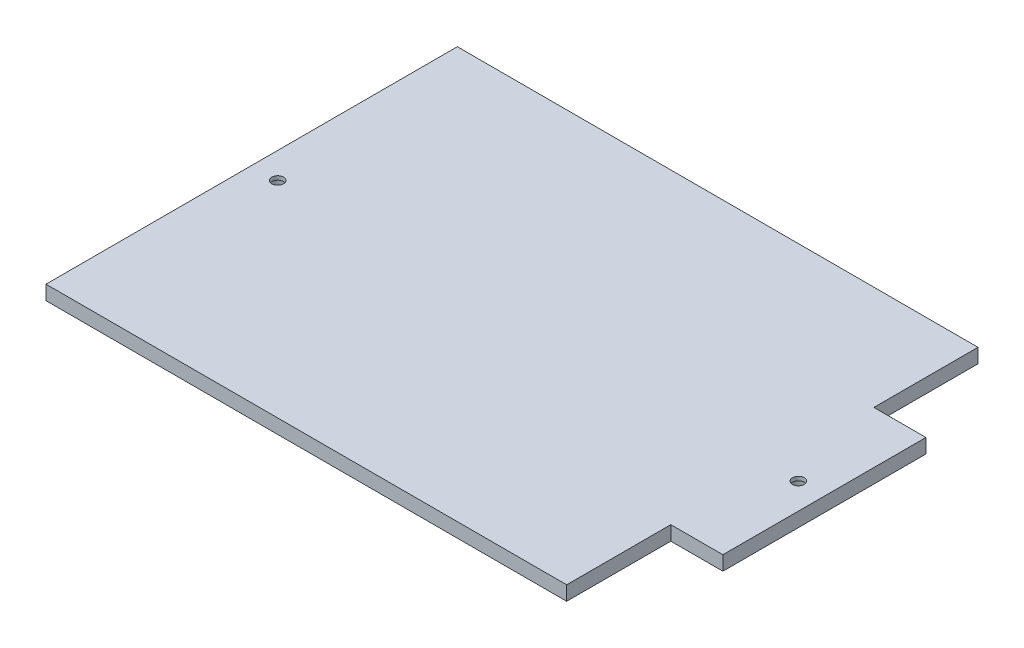
ISO-10303-21;
HEADER;
FILE_DESCRIPTION(('STEP AP214'),'2;1');
FILE_NAME('part.step','',(''),(''),'','','');
FILE_SCHEMA(('AUTOMOTIVE_DESIGN { 1 0 10303 214 1 1 1 1 }'));
ENDSEC;
DATA;
#1=APPLICATION_CONTEXT('core data for automotive mechanical design processes');
#2=APPLICATION_PROTOCOL_DEFINITION('international standard','automotive_design',2000,#1);
#3=PRODUCT_CONTEXT('',#1,'mechanical');
#4=PRODUCT('Part','Part','',(#3));
#5=PRODUCT_RELATED_PRODUCT_CATEGORY('part','',(#4));
#6=PRODUCT_DEFINITION_FORMATION('','',#4);
#7=PRODUCT_DEFINITION_CONTEXT('part definition',#1,'design');
#8=PRODUCT_DEFINITION('design','',#6,#7);
#9=PRODUCT_DEFINITION_SHAPE('','',#8);
#10=(LENGTH_UNIT() NAMED_UNIT(*) SI_UNIT(.MILLI.,.METRE.));
#11=(NAMED_UNIT(*) PLANE_ANGLE_UNIT() SI_UNIT($,.RADIAN.));
#12=(NAMED_UNIT(*) SI_UNIT($,.STERADIAN.) SOLID_ANGLE_UNIT());
#13=UNCERTAINTY_MEASURE_WITH_UNIT(LENGTH_MEASURE(1.E-05),#10,'distance_accuracy_value','');
#14=(GEOMETRIC_REPRESENTATION_CONTEXT(3) GLOBAL_UNCERTAINTY_ASSIGNED_CONTEXT((#13)) GLOBAL_UNIT_ASSIGNED_CONTEXT((#10,
#11,#12)) REPRESENTATION_CONTEXT('',''));
#15=CARTESIAN_POINT('',(0.,0.,0.));
#16=DIRECTION('',(0.,0.,1.));
#17=DIRECTION('',(1.,0.,0.));
#18=AXIS2_PLACEMENT_3D('',#15,#16,#17);
#19=CARTESIAN_POINT('',(110.,5.5,-79.));
#20=DIRECTION('',(-1.,0.,0.));
#21=DIRECTION('',(0.,0.,1.));
#22=AXIS2_PLACEMENT_3D('',#19,#20,#21);
#23=PLANE('',#22);
#24=DIRECTION('',(0.,1.,0.));
#25=VECTOR('',#24,1.);
#26=CARTESIAN_POINT('',(110.,0.,39.));
#27=LINE('',#26,#25);
#28=CARTESIAN_POINT('',(110.,0.,39.));
#29=VERTEX_POINT('',#28);
#30=CARTESIAN_POINT('',(110.,5.5,39.));
#31=VERTEX_POINT('',#30);
#32=EDGE_CURVE('E112',#29,#31,#27,.T.);
#33=ORIENTED_EDGE('',*,*,#32,.F.);
#34=DIRECTION('',(0.,0.,-1.));
#35=VECTOR('',#34,1.);
#36=CARTESIAN_POINT('',(110.,0.,-79.));
#37=LINE('',#36,#35);
#38=CARTESIAN_POINT('',(110.,0.,-39.));
#39=VERTEX_POINT('',#38);
#40=EDGE_CURVE('E124',#29,#39,#37,.T.);
#41=ORIENTED_EDGE('',*,*,#40,.T.);
#42=DIRECTION('',(0.,1.,0.));
#43=VECTOR('',#42,1.);
#44=CARTESIAN_POINT('',(110.,0.,-39.));
#45=LINE('',#44,#43);
#46=CARTESIAN_POINT('',(110.,5.5,-39.));
#47=VERTEX_POINT('',#46);
#48=EDGE_CURVE('E198',#39,#47,#45,.T.);
#49=ORIENTED_EDGE('',*,*,#48,.T.);
#50=DIRECTION('',(0.,0.,-1.));
#51=VECTOR('',#50,1.);
#52=CARTESIAN_POINT('',(110.,5.5,-79.));
#53=LINE('',#52,#51);
#54=EDGE_CURVE('E125',#31,#47,#53,.T.);
#55=ORIENTED_EDGE('',*,*,#54,.F.);
#56=EDGE_LOOP('',(#33,#41,#49,#55));
#57=FACE_BOUND('',#56,.T.);
#58=ADVANCED_FACE('F45',(#57),#23,.F.);
#59=CARTESIAN_POINT('',(-110.,5.5,79.));
#60=DIRECTION('',(0.,0.,-1.));
#61=DIRECTION('',(-1.,0.,0.));
#62=AXIS2_PLACEMENT_3D('',#59,#60,#61);
#63=PLANE('',#62);
#64=DIRECTION('',(0.,1.,0.));
#65=VECTOR('',#64,1.);
#66=CARTESIAN_POINT('',(90.,0.,79.));
#67=LINE('',#66,#65);
#68=CARTESIAN_POINT('',(90.,0.,79.));
#69=VERTEX_POINT('',#68);
#70=CARTESIAN_POINT('',(90.,5.5,79.));
#71=VERTEX_POINT('',#70);
#72=EDGE_CURVE('E214',#69,#71,#67,.T.);
#73=ORIENTED_EDGE('',*,*,#72,.T.);
#74=DIRECTION('',(1.,0.,0.));
#75=VECTOR('',#74,1.);
#76=CARTESIAN_POINT('',(-110.,5.5,79.));
#77=LINE('',#76,#75);
#78=CARTESIAN_POINT('',(-110.,5.5,79.));
#79=VERTEX_POINT('',#78);
#80=EDGE_CURVE('E144',#79,#71,#77,.T.);
#81=ORIENTED_EDGE('',*,*,#80,.F.);
#82=DIRECTION('',(0.,-1.,0.));
#83=VECTOR('',#82,1.);
#84=CARTESIAN_POINT('',(-110.,5.5,79.));
#85=LINE('',#84,#83);
#86=CARTESIAN_POINT('',(-110.,0.,79.));
#87=VERTEX_POINT('',#86);
#88=EDGE_CURVE('E53',#79,#87,#85,.T.);
#89=ORIENTED_EDGE('',*,*,#88,.T.);
#90=DIRECTION('',(1.,0.,0.));
#91=VECTOR('',#90,1.);
#92=CARTESIAN_POINT('',(-110.,0.,79.));
#93=LINE('',#92,#91);
#94=EDGE_CURVE('E149',#87,#69,#93,.T.);
#95=ORIENTED_EDGE('',*,*,#94,.T.);
#96=EDGE_LOOP('',(#73,#81,#89,#95));
#97=FACE_BOUND('',#96,.T.);
#98=ADVANCED_FACE('F233',(#97),#63,.F.);
#99=CARTESIAN_POINT('',(0.,5.5,0.));
#100=DIRECTION('',(0.,1.,0.));
#101=DIRECTION('',(0.,0.,1.));
#102=AXIS2_PLACEMENT_3D('',#99,#100,#101);
#103=PLANE('',#102);
#104=CARTESIAN_POINT('',(-100.,5.5,0.));
#105=DIRECTION('',(0.,-1.,0.));
#106=DIRECTION('',(0.,0.,-1.));
#107=AXIS2_PLACEMENT_3D('',#104,#105,#106);
#108=CIRCLE('',#107,2.25);
#109=CARTESIAN_POINT('',(-100.,5.5,-2.25));
#110=VERTEX_POINT('',#109);
#111=EDGE_CURVE('E183',#110,#110,#108,.T.);
#112=ORIENTED_EDGE('',*,*,#111,.T.);
#113=EDGE_LOOP('',(#112));
#114=FACE_BOUND('',#113,.T.);
#115=CARTESIAN_POINT('',(100.,5.5,0.));
#116=DIRECTION('',(0.,-1.,0.));
#117=DIRECTION('',(0.,0.,-1.));
#118=AXIS2_PLACEMENT_3D('',#115,#116,#117);
#119=CIRCLE('',#118,2.25);
#120=CARTESIAN_POINT('',(100.,5.5,-2.25));
#121=VERTEX_POINT('',#120);
#122=EDGE_CURVE('E132',#121,#121,#119,.T.);
#123=ORIENTED_EDGE('',*,*,#122,.T.);
#124=EDGE_LOOP('',(#123));
#125=FACE_BOUND('',#124,.T.);
#126=ORIENTED_EDGE('',*,*,#80,.T.);
#127=DIRECTION('',(0.,0.,-1.));
#128=VECTOR('',#127,1.);
#129=CARTESIAN_POINT('',(90.,5.5,79.));
#130=LINE('',#129,#128);
#131=CARTESIAN_POINT('',(90.,5.5,39.));
#132=VERTEX_POINT('',#131);
#133=EDGE_CURVE('E119',#71,#132,#130,.T.);
#134=ORIENTED_EDGE('',*,*,#133,.T.);
#135=DIRECTION('',(1.,0.,0.));
#136=VECTOR('',#135,1.);
#137=CARTESIAN_POINT('',(110.,5.5,39.));
#138=LINE('',#137,#136);
#139=EDGE_CURVE('E226',#132,#31,#138,.T.);
#140=ORIENTED_EDGE('',*,*,#139,.T.);
#141=ORIENTED_EDGE('',*,*,#54,.T.);
#142=DIRECTION('',(1.,0.,0.));
#143=VECTOR('',#142,1.);
#144=CARTESIAN_POINT('',(110.,5.5,-39.));
#145=LINE('',#144,#143);
#146=CARTESIAN_POINT('',(90.,5.5,-39.));
#147=VERTEX_POINT('',#146);
#148=EDGE_CURVE('E206',#147,#47,#145,.T.);
#149=ORIENTED_EDGE('',*,*,#148,.F.);
#150=DIRECTION('',(0.,0.,1.));
#151=VECTOR('',#150,1.);
#152=CARTESIAN_POINT('',(90.,5.5,-79.));
#153=LINE('',#152,#151);
#154=CARTESIAN_POINT('',(90.,5.5,-79.));
#155=VERTEX_POINT('',#154);
#156=EDGE_CURVE('E210',#155,#147,#153,.T.);
#157=ORIENTED_EDGE('',*,*,#156,.F.);
#158=DIRECTION('',(-1.,0.,0.));
#159=VECTOR('',#158,1.);
#160=CARTESIAN_POINT('',(-110.,5.5,-79.));
#161=LINE('',#160,#159);
#162=CARTESIAN_POINT('',(-110.,5.5,-79.));
#163=VERTEX_POINT('',#162);
#164=EDGE_CURVE('E165',#155,#163,#161,.T.);
#165=ORIENTED_EDGE('',*,*,#164,.T.);
#166=DIRECTION('',(0.,0.,1.));
#167=VECTOR('',#166,1.);
#168=CARTESIAN_POINT('',(-110.,5.5,-79.));
#169=LINE('',#168,#167);
#170=EDGE_CURVE('E161',#163,#79,#169,.T.);
#171=ORIENTED_EDGE('',*,*,#170,.T.);
#172=EDGE_LOOP('',(#126,#134,#140,#141,#149,#157,#165,#171));
#173=FACE_BOUND('',#172,.T.);
#174=ADVANCED_FACE('F235',(#114,#125,#173),#103,.T.);
#175=CARTESIAN_POINT('',(0.,0.,0.));
#176=DIRECTION('',(0.,1.,0.));
#177=DIRECTION('',(0.,0.,1.));
#178=AXIS2_PLACEMENT_3D('',#175,#176,#177);
#179=PLANE('',#178);
#180=CARTESIAN_POINT('',(100.,0.,0.));
#181=DIRECTION('',(0.,-1.,0.));
#182=DIRECTION('',(0.,0.,-1.));
#183=AXIS2_PLACEMENT_3D('',#180,#181,#182);
#184=CIRCLE('',#183,3.99999999999999);
#185=CARTESIAN_POINT('',(100.,0.,-3.99999999999999));
#186=VERTEX_POINT('',#185);
#187=EDGE_CURVE('E179',#186,#186,#184,.T.);
#188=ORIENTED_EDGE('',*,*,#187,.F.);
#189=EDGE_LOOP('',(#188));
#190=FACE_BOUND('',#189,.T.);
#191=CARTESIAN_POINT('',(-100.,0.,0.));
#192=DIRECTION('',(0.,-1.,0.));
#193=DIRECTION('',(0.,0.,-1.));
#194=AXIS2_PLACEMENT_3D('',#191,#192,#193);
#195=CIRCLE('',#194,3.99999999999999);
#196=CARTESIAN_POINT('',(-100.,0.,-3.99999999999999));
#197=VERTEX_POINT('',#196);
#198=EDGE_CURVE('E194',#197,#197,#195,.T.);
#199=ORIENTED_EDGE('',*,*,#198,.F.);
#200=EDGE_LOOP('',(#199));
#201=FACE_BOUND('',#200,.T.);
#202=DIRECTION('',(0.,0.,-1.));
#203=VECTOR('',#202,1.);
#204=CARTESIAN_POINT('',(90.,0.,79.));
#205=LINE('',#204,#203);
#206=CARTESIAN_POINT('',(90.,0.,39.));
#207=VERTEX_POINT('',#206);
#208=EDGE_CURVE('E118',#69,#207,#205,.T.);
#209=ORIENTED_EDGE('',*,*,#208,.F.);
#210=ORIENTED_EDGE('',*,*,#94,.F.);
#211=DIRECTION('',(0.,0.,1.));
#212=VECTOR('',#211,1.);
#213=CARTESIAN_POINT('',(-110.,0.,-79.));
#214=LINE('',#213,#212);
#215=CARTESIAN_POINT('',(-110.,0.,-79.));
#216=VERTEX_POINT('',#215);
#217=EDGE_CURVE('E137',#216,#87,#214,.T.);
#218=ORIENTED_EDGE('',*,*,#217,.F.);
#219=DIRECTION('',(-1.,0.,0.));
#220=VECTOR('',#219,1.);
#221=CARTESIAN_POINT('',(-110.,0.,-79.));
#222=LINE('',#221,#220);
#223=CARTESIAN_POINT('',(90.,0.,-79.));
#224=VERTEX_POINT('',#223);
#225=EDGE_CURVE('E131',#224,#216,#222,.T.);
#226=ORIENTED_EDGE('',*,*,#225,.F.);
#227=DIRECTION('',(0.,0.,1.));
#228=VECTOR('',#227,1.);
#229=CARTESIAN_POINT('',(90.,0.,-79.));
#230=LINE('',#229,#228);
#231=CARTESIAN_POINT('',(90.,0.,-39.));
#232=VERTEX_POINT('',#231);
#233=EDGE_CURVE('E209',#224,#232,#230,.T.);
#234=ORIENTED_EDGE('',*,*,#233,.T.);
#235=DIRECTION('',(1.,0.,0.));
#236=VECTOR('',#235,1.);
#237=CARTESIAN_POINT('',(110.,0.,-39.));
#238=LINE('',#237,#236);
#239=EDGE_CURVE('E68',#232,#39,#238,.T.);
#240=ORIENTED_EDGE('',*,*,#239,.T.);
#241=ORIENTED_EDGE('',*,*,#40,.F.);
#242=DIRECTION('',(1.,0.,0.));
#243=VECTOR('',#242,1.);
#244=CARTESIAN_POINT('',(110.,0.,39.));
#245=LINE('',#244,#243);
#246=EDGE_CURVE('E109',#207,#29,#245,.T.);
#247=ORIENTED_EDGE('',*,*,#246,.F.);
#248=EDGE_LOOP('',(#209,#210,#218,#226,#234,#240,#241,#247));
#249=FACE_BOUND('',#248,.T.);
#250=ADVANCED_FACE('F128',(#190,#201,#249),#179,.F.);
#251=CARTESIAN_POINT('',(-110.,5.5,-79.));
#252=DIRECTION('',(0.,0.,1.));
#253=DIRECTION('',(1.,0.,0.));
#254=AXIS2_PLACEMENT_3D('',#251,#252,#253);
#255=PLANE('',#254);
#256=ORIENTED_EDGE('',*,*,#164,.F.);
#257=DIRECTION('',(0.,1.,0.));
#258=VECTOR('',#257,1.);
#259=CARTESIAN_POINT('',(90.,0.,-79.));
#260=LINE('',#259,#258);
#261=EDGE_CURVE('E199',#224,#155,#260,.T.);
#262=ORIENTED_EDGE('',*,*,#261,.F.);
#263=ORIENTED_EDGE('',*,*,#225,.T.);
#264=DIRECTION('',(0.,-1.,0.));
#265=VECTOR('',#264,1.);
#266=CARTESIAN_POINT('',(-110.,5.5,-79.));
#267=LINE('',#266,#265);
#268=EDGE_CURVE('E11',#163,#216,#267,.T.);
#269=ORIENTED_EDGE('',*,*,#268,.F.);
#270=EDGE_LOOP('',(#256,#262,#263,#269));
#271=FACE_BOUND('',#270,.T.);
#272=ADVANCED_FACE('F247',(#271),#255,.F.);
#273=CARTESIAN_POINT('',(-110.,5.5,-79.));
#274=DIRECTION('',(1.,0.,0.));
#275=DIRECTION('',(0.,0.,-1.));
#276=AXIS2_PLACEMENT_3D('',#273,#274,#275);
#277=PLANE('',#276);
#278=ORIENTED_EDGE('',*,*,#217,.T.);
#279=ORIENTED_EDGE('',*,*,#88,.F.);
#280=ORIENTED_EDGE('',*,*,#170,.F.);
#281=ORIENTED_EDGE('',*,*,#268,.T.);
#282=EDGE_LOOP('',(#278,#279,#280,#281));
#283=FACE_BOUND('',#282,.T.);
#284=ADVANCED_FACE('F244',(#283),#277,.F.);
#285=CARTESIAN_POINT('',(100.,0.,0.));
#286=DIRECTION('',(0.,-1.,0.));
#287=DIRECTION('',(0.,0.,-1.));
#288=AXIS2_PLACEMENT_3D('',#285,#286,#287);
#289=CYLINDRICAL_SURFACE('',#288,2.25);
#290=ORIENTED_EDGE('',*,*,#122,.F.);
#291=EDGE_LOOP('',(#290));
#292=FACE_BOUND('',#291,.T.);
#293=CARTESIAN_POINT('',(100.,4.,0.));
#294=DIRECTION('',(0.,-1.,0.));
#295=DIRECTION('',(0.,0.,-1.));
#296=AXIS2_PLACEMENT_3D('',#293,#294,#295);
#297=CIRCLE('',#296,2.25);
#298=CARTESIAN_POINT('',(100.,4.,-2.25));
#299=VERTEX_POINT('',#298);
#300=EDGE_CURVE('E141',#299,#299,#297,.T.);
#301=ORIENTED_EDGE('',*,*,#300,.T.);
#302=EDGE_LOOP('',(#301));
#303=FACE_BOUND('',#302,.T.);
#304=ADVANCED_FACE('F246',(#292,#303),#289,.F.);
#305=CARTESIAN_POINT('',(102.25,4.,0.));
#306=DIRECTION('',(0.,1.,0.));
#307=DIRECTION('',(0.,0.,1.));
#308=AXIS2_PLACEMENT_3D('',#305,#306,#307);
#309=PLANE('',#308);
#310=ORIENTED_EDGE('',*,*,#300,.F.);
#311=EDGE_LOOP('',(#310));
#312=FACE_BOUND('',#311,.T.);
#313=CARTESIAN_POINT('',(100.,4.,0.));
#314=DIRECTION('',(0.,-1.,0.));
#315=DIRECTION('',(0.,0.,-1.));
#316=AXIS2_PLACEMENT_3D('',#313,#314,#315);
#317=CIRCLE('',#316,4.);
#318=CARTESIAN_POINT('',(100.,4.,-4.));
#319=VERTEX_POINT('',#318);
#320=EDGE_CURVE('E175',#319,#319,#317,.T.);
#321=ORIENTED_EDGE('',*,*,#320,.T.);
#322=EDGE_LOOP('',(#321));
#323=FACE_BOUND('',#322,.T.);
#324=ADVANCED_FACE('F286',(#312,#323),#309,.F.);
#325=CARTESIAN_POINT('',(100.,0.,0.));
#326=DIRECTION('',(0.,-1.,0.));
#327=DIRECTION('',(0.,0.,-1.));
#328=AXIS2_PLACEMENT_3D('',#325,#326,#327);
#329=CYLINDRICAL_SURFACE('',#328,4.);
#330=ORIENTED_EDGE('',*,*,#320,.F.);
#331=EDGE_LOOP('',(#330));
#332=FACE_BOUND('',#331,.T.);
#333=ORIENTED_EDGE('',*,*,#187,.T.);
#334=EDGE_LOOP('',(#333));
#335=FACE_BOUND('',#334,.T.);
#336=ADVANCED_FACE('F282',(#332,#335),#329,.F.);
#337=CARTESIAN_POINT('',(-100.,0.,0.));
#338=DIRECTION('',(0.,-1.,0.));
#339=DIRECTION('',(0.,0.,-1.));
#340=AXIS2_PLACEMENT_3D('',#337,#338,#339);
#341=CYLINDRICAL_SURFACE('',#340,2.25);
#342=ORIENTED_EDGE('',*,*,#111,.F.);
#343=EDGE_LOOP('',(#342));
#344=FACE_BOUND('',#343,.T.);
#345=CARTESIAN_POINT('',(-100.,4.,0.));
#346=DIRECTION('',(0.,-1.,0.));
#347=DIRECTION('',(0.,0.,-1.));
#348=AXIS2_PLACEMENT_3D('',#345,#346,#347);
#349=CIRCLE('',#348,2.25);
#350=CARTESIAN_POINT('',(-100.,4.,-2.25));
#351=VERTEX_POINT('',#350);
#352=EDGE_CURVE('E186',#351,#351,#349,.T.);
#353=ORIENTED_EDGE('',*,*,#352,.T.);
#354=EDGE_LOOP('',(#353));
#355=FACE_BOUND('',#354,.T.);
#356=ADVANCED_FACE('F278',(#344,#355),#341,.F.);
#357=CARTESIAN_POINT('',(-97.75,4.,0.));
#358=DIRECTION('',(0.,1.,0.));
#359=DIRECTION('',(0.,0.,1.));
#360=AXIS2_PLACEMENT_3D('',#357,#358,#359);
#361=PLANE('',#360);
#362=ORIENTED_EDGE('',*,*,#352,.F.);
#363=EDGE_LOOP('',(#362));
#364=FACE_BOUND('',#363,.T.);
#365=CARTESIAN_POINT('',(-100.,4.,0.));
#366=DIRECTION('',(0.,-1.,0.));
#367=DIRECTION('',(0.,0.,-1.));
#368=AXIS2_PLACEMENT_3D('',#365,#366,#367);
#369=CIRCLE('',#368,4.);
#370=CARTESIAN_POINT('',(-100.,4.,-4.));
#371=VERTEX_POINT('',#370);
#372=EDGE_CURVE('E190',#371,#371,#369,.T.);
#373=ORIENTED_EDGE('',*,*,#372,.T.);
#374=EDGE_LOOP('',(#373));
#375=FACE_BOUND('',#374,.T.);
#376=ADVANCED_FACE('F270',(#364,#375),#361,.F.);
#377=CARTESIAN_POINT('',(-100.,0.,0.));
#378=DIRECTION('',(0.,-1.,0.));
#379=DIRECTION('',(0.,0.,-1.));
#380=AXIS2_PLACEMENT_3D('',#377,#378,#379);
#381=CYLINDRICAL_SURFACE('',#380,4.);
#382=ORIENTED_EDGE('',*,*,#372,.F.);
#383=EDGE_LOOP('',(#382));
#384=FACE_BOUND('',#383,.T.);
#385=ORIENTED_EDGE('',*,*,#198,.T.);
#386=EDGE_LOOP('',(#385));
#387=FACE_BOUND('',#386,.T.);
#388=ADVANCED_FACE('F264',(#384,#387),#381,.F.);
#389=CARTESIAN_POINT('',(110.,0.,-39.));
#390=DIRECTION('',(0.,0.,1.));
#391=DIRECTION('',(1.,0.,0.));
#392=AXIS2_PLACEMENT_3D('',#389,#390,#391);
#393=PLANE('',#392);
#394=ORIENTED_EDGE('',*,*,#148,.T.);
#395=ORIENTED_EDGE('',*,*,#48,.F.);
#396=ORIENTED_EDGE('',*,*,#239,.F.);
#397=DIRECTION('',(0.,1.,0.));
#398=VECTOR('',#397,1.);
#399=CARTESIAN_POINT('',(90.,0.,-39.));
#400=LINE('',#399,#398);
#401=EDGE_CURVE('E201',#232,#147,#400,.T.);
#402=ORIENTED_EDGE('',*,*,#401,.T.);
#403=EDGE_LOOP('',(#394,#395,#396,#402));
#404=FACE_BOUND('',#403,.T.);
#405=ADVANCED_FACE('F262',(#404),#393,.F.);
#406=CARTESIAN_POINT('',(90.,0.,-79.));
#407=DIRECTION('',(-1.,0.,0.));
#408=DIRECTION('',(0.,0.,1.));
#409=AXIS2_PLACEMENT_3D('',#406,#407,#408);
#410=PLANE('',#409);
#411=ORIENTED_EDGE('',*,*,#156,.T.);
#412=ORIENTED_EDGE('',*,*,#401,.F.);
#413=ORIENTED_EDGE('',*,*,#233,.F.);
#414=ORIENTED_EDGE('',*,*,#261,.T.);
#415=EDGE_LOOP('',(#411,#412,#413,#414));
#416=FACE_BOUND('',#415,.T.);
#417=ADVANCED_FACE('F261',(#416),#410,.F.);
#418=CARTESIAN_POINT('',(90.,0.,79.));
#419=DIRECTION('',(1.,0.,0.));
#420=DIRECTION('',(0.,0.,-1.));
#421=AXIS2_PLACEMENT_3D('',#418,#419,#420);
#422=PLANE('',#421);
#423=ORIENTED_EDGE('',*,*,#133,.F.);
#424=ORIENTED_EDGE('',*,*,#72,.F.);
#425=ORIENTED_EDGE('',*,*,#208,.T.);
#426=DIRECTION('',(0.,1.,0.));
#427=VECTOR('',#426,1.);
#428=CARTESIAN_POINT('',(90.,0.,39.));
#429=LINE('',#428,#427);
#430=EDGE_CURVE('E60',#207,#132,#429,.T.);
#431=ORIENTED_EDGE('',*,*,#430,.T.);
#432=EDGE_LOOP('',(#423,#424,#425,#431));
#433=FACE_BOUND('',#432,.T.);
#434=ADVANCED_FACE('F231',(#433),#422,.T.);
#435=CARTESIAN_POINT('',(110.,0.,39.));
#436=DIRECTION('',(0.,0.,1.));
#437=DIRECTION('',(1.,0.,0.));
#438=AXIS2_PLACEMENT_3D('',#435,#436,#437);
#439=PLANE('',#438);
#440=ORIENTED_EDGE('',*,*,#139,.F.);
#441=ORIENTED_EDGE('',*,*,#430,.F.);
#442=ORIENTED_EDGE('',*,*,#246,.T.);
#443=ORIENTED_EDGE('',*,*,#32,.T.);
#444=EDGE_LOOP('',(#440,#441,#442,#443));
#445=FACE_BOUND('',#444,.T.);
#446=ADVANCED_FACE('F111',(#445),#439,.T.);
#447=CLOSED_SHELL('',(#58,#98,#174,#250,#272,#284,#304,#324,#336,#356,#376,#388,#405,#417,#434,#446));
#448=MANIFOLD_SOLID_BREP('B2',#447);
#449=ADVANCED_BREP_SHAPE_REPRESENTATION('',(#18,#448),#14);
#450=SHAPE_DEFINITION_REPRESENTATION(#9,#449);
ENDSEC;
END-ISO-10303-21;
